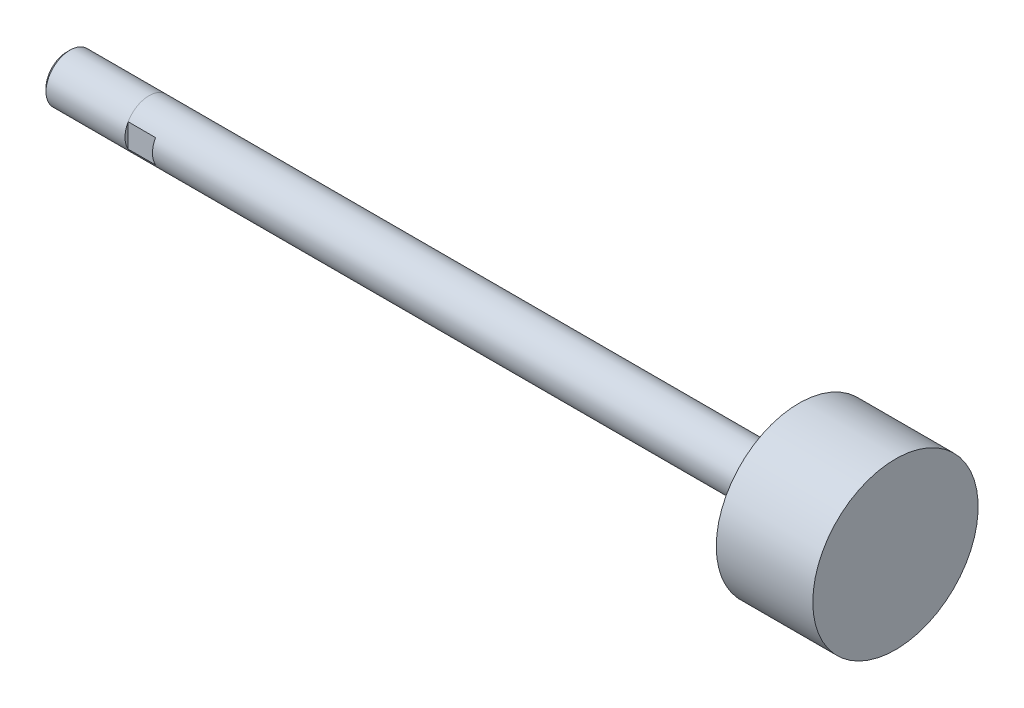
ISO-10303-21;
HEADER;
FILE_DESCRIPTION(('STEP AP214'),'2;1');
FILE_NAME('part.step','',(''),(''),'','','');
FILE_SCHEMA(('AUTOMOTIVE_DESIGN { 1 0 10303 214 1 1 1 1 }'));
ENDSEC;
DATA;
#1=APPLICATION_CONTEXT('core data for automotive mechanical design processes');
#2=APPLICATION_PROTOCOL_DEFINITION('international standard','automotive_design',2000,#1);
#3=PRODUCT_CONTEXT('',#1,'mechanical');
#4=PRODUCT('Part','Part','',(#3));
#5=PRODUCT_RELATED_PRODUCT_CATEGORY('part','',(#4));
#6=PRODUCT_DEFINITION_FORMATION('','',#4);
#7=PRODUCT_DEFINITION_CONTEXT('part definition',#1,'design');
#8=PRODUCT_DEFINITION('design','',#6,#7);
#9=PRODUCT_DEFINITION_SHAPE('','',#8);
#10=(LENGTH_UNIT() NAMED_UNIT(*) SI_UNIT(.MILLI.,.METRE.));
#11=(NAMED_UNIT(*) PLANE_ANGLE_UNIT() SI_UNIT($,.RADIAN.));
#12=(NAMED_UNIT(*) SI_UNIT($,.STERADIAN.) SOLID_ANGLE_UNIT());
#13=UNCERTAINTY_MEASURE_WITH_UNIT(LENGTH_MEASURE(1.E-05),#10,'distance_accuracy_value','');
#14=(GEOMETRIC_REPRESENTATION_CONTEXT(3) GLOBAL_UNCERTAINTY_ASSIGNED_CONTEXT((#13)) GLOBAL_UNIT_ASSIGNED_CONTEXT((#10,
#11,#12)) REPRESENTATION_CONTEXT('',''));
#15=CARTESIAN_POINT('',(0.,0.,0.));
#16=DIRECTION('',(0.,0.,1.));
#17=DIRECTION('',(1.,0.,0.));
#18=AXIS2_PLACEMENT_3D('',#15,#16,#17);
#19=CARTESIAN_POINT('',(166.497,0.,0.));
#20=DIRECTION('',(-1.,0.,0.));
#21=DIRECTION('',(0.,0.,1.));
#22=AXIS2_PLACEMENT_3D('',#19,#20,#21);
#23=CYLINDRICAL_SURFACE('',#22,5.5499);
#24=DIRECTION('',(-1.,0.,0.));
#25=VECTOR('',#24,1.);
#26=CARTESIAN_POINT('',(166.497,2.74064116768321,-4.826));
#27=LINE('',#26,#25);
#28=CARTESIAN_POINT('',(0.,2.74064116768321,-4.826));
#29=VERTEX_POINT('',#28);
#30=CARTESIAN_POINT('',(-6.35,2.74705930837324,-4.826));
#31=VERTEX_POINT('',#30);
#32=EDGE_CURVE('E104',#29,#31,#27,.T.);
#33=ORIENTED_EDGE('',*,*,#32,.T.);
#34=CARTESIAN_POINT('',(-6.35,0.,0.));
#35=DIRECTION('',(-1.,0.,0.));
#36=DIRECTION('',(0.,0.49469130573276,0.869068761394872));
#37=AXIS2_PLACEMENT_3D('',#34,#35,#36);
#38=CIRCLE('',#37,5.55625);
#39=CARTESIAN_POINT('',(-6.35,2.74705792258195,4.82600401218283));
#40=VERTEX_POINT('',#39);
#41=EDGE_CURVE('E84',#40,#31,#38,.T.);
#42=ORIENTED_EDGE('',*,*,#41,.F.);
#43=DIRECTION('',(-1.,0.,0.));
#44=VECTOR('',#43,1.);
#45=CARTESIAN_POINT('',(166.497,2.74064116768321,4.826));
#46=LINE('',#45,#44);
#47=CARTESIAN_POINT('',(0.,2.74064116768321,4.826));
#48=VERTEX_POINT('',#47);
#49=EDGE_CURVE('E113',#40,#48,#46,.F.);
#50=ORIENTED_EDGE('',*,*,#49,.T.);
#51=CARTESIAN_POINT('',(0.,0.,0.));
#52=DIRECTION('',(1.,0.,0.));
#53=DIRECTION('',(0.,0.,-1.));
#54=AXIS2_PLACEMENT_3D('',#51,#52,#53);
#55=CIRCLE('',#54,5.5499);
#56=CARTESIAN_POINT('',(0.,-2.74064116768321,4.826));
#57=VERTEX_POINT('',#56);
#58=EDGE_CURVE('E11',#48,#57,#55,.T.);
#59=ORIENTED_EDGE('',*,*,#58,.T.);
#60=DIRECTION('',(-1.,0.,0.));
#61=VECTOR('',#60,1.);
#62=CARTESIAN_POINT('',(166.497,-2.74064116768321,4.826));
#63=LINE('',#62,#61);
#64=CARTESIAN_POINT('',(-6.35,-2.74705930837324,4.826));
#65=VERTEX_POINT('',#64);
#66=EDGE_CURVE('E115',#57,#65,#63,.T.);
#67=ORIENTED_EDGE('',*,*,#66,.T.);
#68=CARTESIAN_POINT('',(-6.35,0.,0.));
#69=DIRECTION('',(-1.,0.,0.));
#70=DIRECTION('',(0.,-0.494691305732761,-0.869068761394871));
#71=AXIS2_PLACEMENT_3D('',#68,#69,#70);
#72=CIRCLE('',#71,5.55625);
#73=CARTESIAN_POINT('',(-6.35,-2.74705792258195,-4.82600401218282));
#74=VERTEX_POINT('',#73);
#75=EDGE_CURVE('E98',#74,#65,#72,.T.);
#76=ORIENTED_EDGE('',*,*,#75,.F.);
#77=DIRECTION('',(-1.,0.,0.));
#78=VECTOR('',#77,1.);
#79=CARTESIAN_POINT('',(166.497,-2.74064116768321,-4.826));
#80=LINE('',#79,#78);
#81=CARTESIAN_POINT('',(0.,-2.74064116768321,-4.826));
#82=VERTEX_POINT('',#81);
#83=EDGE_CURVE('E107',#74,#82,#80,.F.);
#84=ORIENTED_EDGE('',*,*,#83,.T.);
#85=EDGE_CURVE('E44',#82,#29,#55,.T.);
#86=ORIENTED_EDGE('',*,*,#85,.T.);
#87=EDGE_LOOP('',(#33,#42,#50,#59,#67,#76,#84,#86));
#88=FACE_BOUND('',#87,.T.);
#89=CARTESIAN_POINT('',(144.145,0.,0.));
#90=DIRECTION('',(-1.,0.,0.));
#91=DIRECTION('',(0.,0.,1.));
#92=AXIS2_PLACEMENT_3D('',#89,#90,#91);
#93=CIRCLE('',#92,5.5499);
#94=CARTESIAN_POINT('',(144.145,0.,5.5499));
#95=VERTEX_POINT('',#94);
#96=EDGE_CURVE('E203',#95,#95,#93,.T.);
#97=ORIENTED_EDGE('',*,*,#96,.T.);
#98=EDGE_LOOP('',(#97));
#99=FACE_BOUND('',#98,.T.);
#100=ADVANCED_FACE('F40',(#88,#99),#23,.T.);
#101=CARTESIAN_POINT('',(144.145,5.5499,0.));
#102=DIRECTION('',(1.,0.,0.));
#103=DIRECTION('',(0.,0.,-1.));
#104=AXIS2_PLACEMENT_3D('',#101,#102,#103);
#105=PLANE('',#104);
#106=ORIENTED_EDGE('',*,*,#96,.F.);
#107=EDGE_LOOP('',(#106));
#108=FACE_BOUND('',#107,.T.);
#109=CARTESIAN_POINT('',(144.145,0.,0.));
#110=DIRECTION('',(-1.,0.,0.));
#111=DIRECTION('',(0.,0.,1.));
#112=AXIS2_PLACEMENT_3D('',#109,#110,#111);
#113=CIRCLE('',#112,19.14525);
#114=CARTESIAN_POINT('',(144.145,0.,19.14525));
#115=VERTEX_POINT('',#114);
#116=EDGE_CURVE('E205',#115,#115,#113,.T.);
#117=ORIENTED_EDGE('',*,*,#116,.T.);
#118=EDGE_LOOP('',(#117));
#119=FACE_BOUND('',#118,.T.);
#120=ADVANCED_FACE('F223',(#108,#119),#105,.F.);
#121=CARTESIAN_POINT('',(166.497,0.,0.));
#122=DIRECTION('',(-1.,0.,0.));
#123=DIRECTION('',(0.,0.,1.));
#124=AXIS2_PLACEMENT_3D('',#121,#122,#123);
#125=CYLINDRICAL_SURFACE('',#124,19.14525);
#126=ORIENTED_EDGE('',*,*,#116,.F.);
#127=EDGE_LOOP('',(#126));
#128=FACE_BOUND('',#127,.T.);
#129=CARTESIAN_POINT('',(166.497,0.,0.));
#130=DIRECTION('',(-1.,0.,0.));
#131=DIRECTION('',(0.,0.,1.));
#132=AXIS2_PLACEMENT_3D('',#129,#130,#131);
#133=CIRCLE('',#132,19.14525);
#134=CARTESIAN_POINT('',(166.497,0.,19.14525));
#135=VERTEX_POINT('',#134);
#136=EDGE_CURVE('E148',#135,#135,#133,.T.);
#137=ORIENTED_EDGE('',*,*,#136,.T.);
#138=EDGE_LOOP('',(#137));
#139=FACE_BOUND('',#138,.T.);
#140=ADVANCED_FACE('F212',(#128,#139),#125,.T.);
#141=CARTESIAN_POINT('',(166.497,19.14525,0.));
#142=DIRECTION('',(-1.,0.,0.));
#143=DIRECTION('',(0.,0.,1.));
#144=AXIS2_PLACEMENT_3D('',#141,#142,#143);
#145=PLANE('',#144);
#146=ORIENTED_EDGE('',*,*,#136,.F.);
#147=EDGE_LOOP('',(#146));
#148=FACE_BOUND('',#147,.T.);
#149=ADVANCED_FACE('F214',(#148),#145,.F.);
#150=CARTESIAN_POINT('',(-25.4,0.,0.));
#151=DIRECTION('',(1.,0.,0.));
#152=DIRECTION('',(0.,0.,-1.));
#153=AXIS2_PLACEMENT_3D('',#150,#151,#152);
#154=PLANE('',#153);
#155=CARTESIAN_POINT('',(-25.4,0.,0.));
#156=DIRECTION('',(-1.,0.,0.));
#157=DIRECTION('',(0.,0.,1.));
#158=AXIS2_PLACEMENT_3D('',#155,#156,#157);
#159=CIRCLE('',#158,4.8006);
#160=CARTESIAN_POINT('',(-25.4,0.,4.8006));
#161=VERTEX_POINT('',#160);
#162=EDGE_CURVE('E141',#161,#161,#159,.T.);
#163=ORIENTED_EDGE('',*,*,#162,.T.);
#164=EDGE_LOOP('',(#163));
#165=FACE_BOUND('',#164,.T.);
#166=ADVANCED_FACE('F216',(#165),#154,.F.);
#167=CARTESIAN_POINT('',(-24.64435,0.,0.));
#168=DIRECTION('',(1.,0.,0.));
#169=DIRECTION('',(0.,0.,-1.));
#170=AXIS2_PLACEMENT_3D('',#167,#168,#169);
#171=CONICAL_SURFACE('',#170,5.55625,0.785398163397451);
#172=ORIENTED_EDGE('',*,*,#162,.F.);
#173=EDGE_LOOP('',(#172));
#174=FACE_BOUND('',#173,.T.);
#175=CARTESIAN_POINT('',(-24.64435,0.,0.));
#176=DIRECTION('',(-1.,0.,0.));
#177=DIRECTION('',(0.,0.,1.));
#178=AXIS2_PLACEMENT_3D('',#175,#176,#177);
#179=CIRCLE('',#178,5.55625);
#180=CARTESIAN_POINT('',(-24.64435,0.,5.55625));
#181=VERTEX_POINT('',#180);
#182=EDGE_CURVE('E138',#181,#181,#179,.T.);
#183=ORIENTED_EDGE('',*,*,#182,.T.);
#184=EDGE_LOOP('',(#183));
#185=FACE_BOUND('',#184,.T.);
#186=ADVANCED_FACE('F176',(#174,#185),#171,.T.);
#187=CARTESIAN_POINT('',(-6.35,0.,0.));
#188=DIRECTION('',(-1.,0.,0.));
#189=DIRECTION('',(0.,0.,1.));
#190=AXIS2_PLACEMENT_3D('',#187,#188,#189);
#191=CYLINDRICAL_SURFACE('',#190,5.55625);
#192=ORIENTED_EDGE('',*,*,#182,.F.);
#193=EDGE_LOOP('',(#192));
#194=FACE_BOUND('',#193,.T.);
#195=ORIENTED_EDGE('',*,*,#41,.T.);
#196=CARTESIAN_POINT('',(-6.35,0.,0.));
#197=DIRECTION('',(-1.,0.,0.));
#198=DIRECTION('',(0.,0.494691305732778,-0.869068761394862));
#199=AXIS2_PLACEMENT_3D('',#196,#197,#198);
#200=CIRCLE('',#199,5.55625);
#201=EDGE_CURVE('E87',#31,#74,#200,.T.);
#202=ORIENTED_EDGE('',*,*,#201,.T.);
#203=ORIENTED_EDGE('',*,*,#75,.T.);
#204=CARTESIAN_POINT('',(-6.35,0.,0.));
#205=DIRECTION('',(-1.,0.,0.));
#206=DIRECTION('',(0.,-0.494691305732759,0.869068761394873));
#207=AXIS2_PLACEMENT_3D('',#204,#205,#206);
#208=CIRCLE('',#207,5.55625);
#209=EDGE_CURVE('E89',#65,#40,#208,.T.);
#210=ORIENTED_EDGE('',*,*,#209,.T.);
#211=EDGE_LOOP('',(#195,#202,#203,#210));
#212=FACE_BOUND('',#211,.T.);
#213=ADVANCED_FACE('F86',(#194,#212),#191,.T.);
#214=CARTESIAN_POINT('',(-6.35,0.,0.));
#215=DIRECTION('',(1.,0.,0.));
#216=DIRECTION('',(0.,0.,-1.));
#217=AXIS2_PLACEMENT_3D('',#214,#215,#216);
#218=PLANE('',#217);
#219=ORIENTED_EDGE('',*,*,#201,.F.);
#220=DIRECTION('',(0.,1.,0.));
#221=VECTOR('',#220,1.);
#222=CARTESIAN_POINT('',(-6.35,-5.5499,-4.826));
#223=LINE('',#222,#221);
#224=EDGE_CURVE('E54',#74,#31,#223,.T.);
#225=ORIENTED_EDGE('',*,*,#224,.F.);
#226=EDGE_LOOP('',(#219,#225));
#227=FACE_BOUND('',#226,.T.);
#228=ADVANCED_FACE('F97',(#227),#218,.T.);
#229=CARTESIAN_POINT('',(0.,-5.5499,-4.826));
#230=DIRECTION('',(0.,0.,1.));
#231=DIRECTION('',(1.,0.,0.));
#232=AXIS2_PLACEMENT_3D('',#229,#230,#231);
#233=PLANE('',#232);
#234=DIRECTION('',(0.,1.,0.));
#235=VECTOR('',#234,1.);
#236=CARTESIAN_POINT('',(0.,-5.5499,-4.826));
#237=LINE('',#236,#235);
#238=EDGE_CURVE('E117',#82,#29,#237,.T.);
#239=ORIENTED_EDGE('',*,*,#238,.F.);
#240=ORIENTED_EDGE('',*,*,#83,.F.);
#241=ORIENTED_EDGE('',*,*,#224,.T.);
#242=ORIENTED_EDGE('',*,*,#32,.F.);
#243=EDGE_LOOP('',(#239,#240,#241,#242));
#244=FACE_BOUND('',#243,.T.);
#245=ADVANCED_FACE('F103',(#244),#233,.F.);
#246=CARTESIAN_POINT('',(0.,0.,0.));
#247=DIRECTION('',(1.,0.,0.));
#248=DIRECTION('',(0.,0.,-1.));
#249=AXIS2_PLACEMENT_3D('',#246,#247,#248);
#250=PLANE('',#249);
#251=ORIENTED_EDGE('',*,*,#238,.T.);
#252=ORIENTED_EDGE('',*,*,#85,.F.);
#253=EDGE_LOOP('',(#251,#252));
#254=FACE_BOUND('',#253,.T.);
#255=ADVANCED_FACE('F264',(#254),#250,.F.);
#256=DIRECTION('',(0.,-1.,0.));
#257=VECTOR('',#256,1.);
#258=CARTESIAN_POINT('',(0.,5.5499,4.826));
#259=LINE('',#258,#257);
#260=EDGE_CURVE('E109',#48,#57,#259,.T.);
#261=ORIENTED_EDGE('',*,*,#260,.T.);
#262=ORIENTED_EDGE('',*,*,#58,.F.);
#263=EDGE_LOOP('',(#261,#262));
#264=FACE_BOUND('',#263,.T.);
#265=ADVANCED_FACE('F134',(#264),#250,.F.);
#266=ORIENTED_EDGE('',*,*,#209,.F.);
#267=DIRECTION('',(0.,-1.,0.));
#268=VECTOR('',#267,1.);
#269=CARTESIAN_POINT('',(-6.35,5.5499,4.826));
#270=LINE('',#269,#268);
#271=EDGE_CURVE('E61',#40,#65,#270,.T.);
#272=ORIENTED_EDGE('',*,*,#271,.F.);
#273=EDGE_LOOP('',(#266,#272));
#274=FACE_BOUND('',#273,.T.);
#275=ADVANCED_FACE('F154',(#274),#218,.T.);
#276=CARTESIAN_POINT('',(0.,5.5499,4.826));
#277=DIRECTION('',(0.,0.,-1.));
#278=DIRECTION('',(-1.,0.,0.));
#279=AXIS2_PLACEMENT_3D('',#276,#277,#278);
#280=PLANE('',#279);
#281=ORIENTED_EDGE('',*,*,#260,.F.);
#282=ORIENTED_EDGE('',*,*,#49,.F.);
#283=ORIENTED_EDGE('',*,*,#271,.T.);
#284=ORIENTED_EDGE('',*,*,#66,.F.);
#285=EDGE_LOOP('',(#281,#282,#283,#284));
#286=FACE_BOUND('',#285,.T.);
#287=ADVANCED_FACE('F137',(#286),#280,.F.);
#288=CLOSED_SHELL('',(#100,#120,#140,#149,#166,#186,#213,#228,#245,#255,#265,#275,#287));
#289=MANIFOLD_SOLID_BREP('B2',#288);
#290=ADVANCED_BREP_SHAPE_REPRESENTATION('',(#18,#289),#14);
#291=SHAPE_DEFINITION_REPRESENTATION(#9,#290);
ENDSEC;
END-ISO-10303-21;
